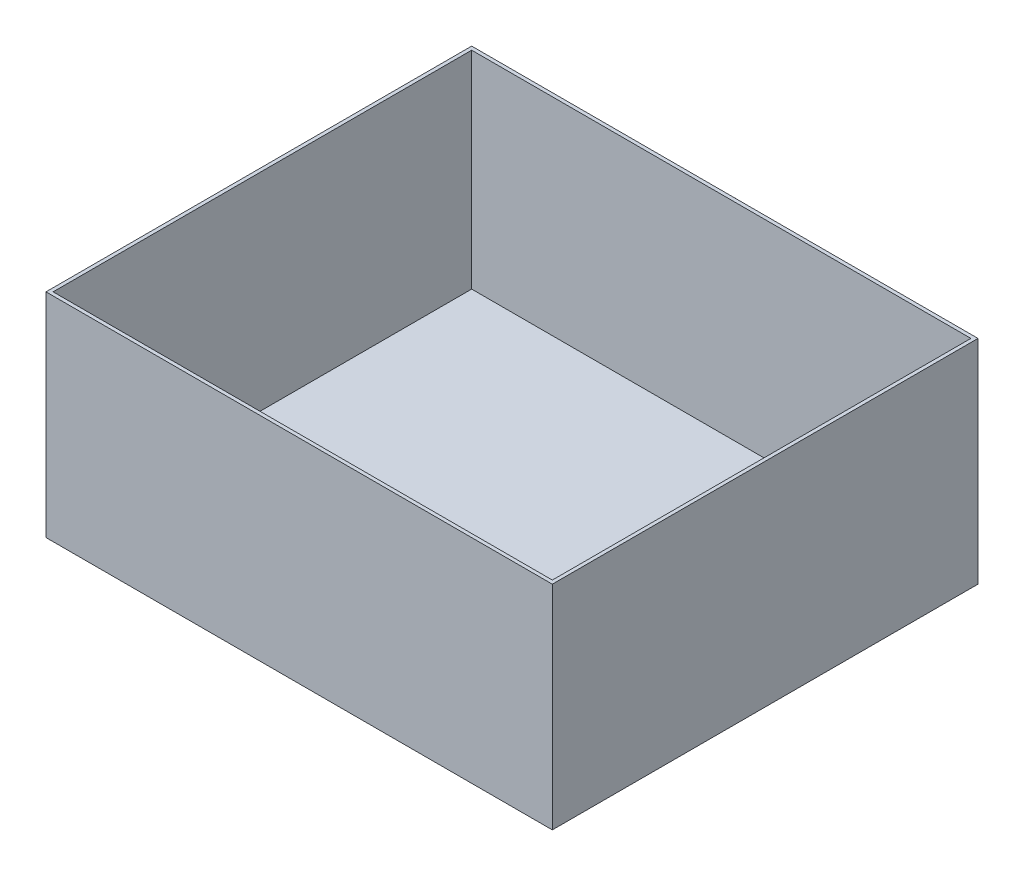
ISO-10303-21;
HEADER;
FILE_DESCRIPTION(('STEP AP214'),'2;1');
FILE_NAME('part.step','',(''),(''),'','','');
FILE_SCHEMA(('AUTOMOTIVE_DESIGN { 1 0 10303 214 1 1 1 1 }'));
ENDSEC;
DATA;
#1=APPLICATION_CONTEXT('core data for automotive mechanical design processes');
#2=APPLICATION_PROTOCOL_DEFINITION('international standard','automotive_design',2000,#1);
#3=PRODUCT_CONTEXT('',#1,'mechanical');
#4=PRODUCT('Part','Part','',(#3));
#5=PRODUCT_RELATED_PRODUCT_CATEGORY('part','',(#4));
#6=PRODUCT_DEFINITION_FORMATION('','',#4);
#7=PRODUCT_DEFINITION_CONTEXT('part definition',#1,'design');
#8=PRODUCT_DEFINITION('design','',#6,#7);
#9=PRODUCT_DEFINITION_SHAPE('','',#8);
#10=(LENGTH_UNIT() NAMED_UNIT(*) SI_UNIT(.MILLI.,.METRE.));
#11=(NAMED_UNIT(*) PLANE_ANGLE_UNIT() SI_UNIT($,.RADIAN.));
#12=(NAMED_UNIT(*) SI_UNIT($,.STERADIAN.) SOLID_ANGLE_UNIT());
#13=UNCERTAINTY_MEASURE_WITH_UNIT(LENGTH_MEASURE(1.E-05),#10,'distance_accuracy_value','');
#14=(GEOMETRIC_REPRESENTATION_CONTEXT(3) GLOBAL_UNCERTAINTY_ASSIGNED_CONTEXT((#13)) GLOBAL_UNIT_ASSIGNED_CONTEXT((#10,
#11,#12)) REPRESENTATION_CONTEXT('',''));
#15=CARTESIAN_POINT('',(0.,0.,0.));
#16=DIRECTION('',(0.,0.,1.));
#17=DIRECTION('',(1.,0.,0.));
#18=AXIS2_PLACEMENT_3D('',#15,#16,#17);
#19=CARTESIAN_POINT('',(0.,90.,0.));
#20=DIRECTION('',(1.,0.,0.));
#21=DIRECTION('',(0.,0.,-1.));
#22=AXIS2_PLACEMENT_3D('',#19,#20,#21);
#23=PLANE('',#22);
#24=DIRECTION('',(0.,0.,1.));
#25=VECTOR('',#24,1.);
#26=CARTESIAN_POINT('',(0.,0.,0.));
#27=LINE('',#26,#25);
#28=CARTESIAN_POINT('',(0.,0.,-180.));
#29=VERTEX_POINT('',#28);
#30=CARTESIAN_POINT('',(0.,0.,0.));
#31=VERTEX_POINT('',#30);
#32=EDGE_CURVE('E140',#29,#31,#27,.T.);
#33=ORIENTED_EDGE('',*,*,#32,.T.);
#34=DIRECTION('',(0.,-1.,0.));
#35=VECTOR('',#34,1.);
#36=CARTESIAN_POINT('',(0.,90.,0.));
#37=LINE('',#36,#35);
#38=CARTESIAN_POINT('',(0.,90.,0.));
#39=VERTEX_POINT('',#38);
#40=EDGE_CURVE('E11',#39,#31,#37,.T.);
#41=ORIENTED_EDGE('',*,*,#40,.F.);
#42=DIRECTION('',(0.,0.,1.));
#43=VECTOR('',#42,1.);
#44=CARTESIAN_POINT('',(0.,90.,0.));
#45=LINE('',#44,#43);
#46=CARTESIAN_POINT('',(0.,90.,-180.));
#47=VERTEX_POINT('',#46);
#48=EDGE_CURVE('E144',#47,#39,#45,.T.);
#49=ORIENTED_EDGE('',*,*,#48,.F.);
#50=DIRECTION('',(0.,-1.,0.));
#51=VECTOR('',#50,1.);
#52=CARTESIAN_POINT('',(0.,90.,-180.));
#53=LINE('',#52,#51);
#54=EDGE_CURVE('E150',#47,#29,#53,.T.);
#55=ORIENTED_EDGE('',*,*,#54,.T.);
#56=EDGE_LOOP('',(#33,#41,#49,#55));
#57=FACE_BOUND('',#56,.T.);
#58=ADVANCED_FACE('F32',(#57),#23,.F.);
#59=CARTESIAN_POINT('',(0.,90.,0.));
#60=DIRECTION('',(0.,0.,-1.));
#61=DIRECTION('',(-1.,0.,0.));
#62=AXIS2_PLACEMENT_3D('',#59,#60,#61);
#63=PLANE('',#62);
#64=DIRECTION('',(1.,0.,0.));
#65=VECTOR('',#64,1.);
#66=CARTESIAN_POINT('',(0.,0.,0.));
#67=LINE('',#66,#65);
#68=CARTESIAN_POINT('',(214.105532568095,0.,0.));
#69=VERTEX_POINT('',#68);
#70=EDGE_CURVE('E153',#31,#69,#67,.T.);
#71=ORIENTED_EDGE('',*,*,#70,.T.);
#72=DIRECTION('',(0.,-1.,0.));
#73=VECTOR('',#72,1.);
#74=CARTESIAN_POINT('',(214.105532568095,90.,0.));
#75=LINE('',#74,#73);
#76=CARTESIAN_POINT('',(214.105532568095,90.,0.));
#77=VERTEX_POINT('',#76);
#78=EDGE_CURVE('E39',#77,#69,#75,.T.);
#79=ORIENTED_EDGE('',*,*,#78,.F.);
#80=DIRECTION('',(1.,0.,0.));
#81=VECTOR('',#80,1.);
#82=CARTESIAN_POINT('',(0.,90.,0.));
#83=LINE('',#82,#81);
#84=EDGE_CURVE('E83',#39,#77,#83,.T.);
#85=ORIENTED_EDGE('',*,*,#84,.F.);
#86=ORIENTED_EDGE('',*,*,#40,.T.);
#87=EDGE_LOOP('',(#71,#79,#85,#86));
#88=FACE_BOUND('',#87,.T.);
#89=ADVANCED_FACE('F182',(#88),#63,.F.);
#90=CARTESIAN_POINT('',(214.105532568095,90.,0.));
#91=DIRECTION('',(-1.,0.,0.));
#92=DIRECTION('',(0.,0.,1.));
#93=AXIS2_PLACEMENT_3D('',#90,#91,#92);
#94=PLANE('',#93);
#95=DIRECTION('',(0.,0.,-1.));
#96=VECTOR('',#95,1.);
#97=CARTESIAN_POINT('',(214.105532568095,0.,0.));
#98=LINE('',#97,#96);
#99=CARTESIAN_POINT('',(214.105532568095,0.,-180.));
#100=VERTEX_POINT('',#99);
#101=EDGE_CURVE('E155',#69,#100,#98,.T.);
#102=ORIENTED_EDGE('',*,*,#101,.T.);
#103=DIRECTION('',(0.,-1.,0.));
#104=VECTOR('',#103,1.);
#105=CARTESIAN_POINT('',(214.105532568095,90.,-180.));
#106=LINE('',#105,#104);
#107=CARTESIAN_POINT('',(214.105532568095,90.,-180.));
#108=VERTEX_POINT('',#107);
#109=EDGE_CURVE('E159',#108,#100,#106,.T.);
#110=ORIENTED_EDGE('',*,*,#109,.F.);
#111=DIRECTION('',(0.,0.,-1.));
#112=VECTOR('',#111,1.);
#113=CARTESIAN_POINT('',(214.105532568095,90.,0.));
#114=LINE('',#113,#112);
#115=EDGE_CURVE('E147',#77,#108,#114,.T.);
#116=ORIENTED_EDGE('',*,*,#115,.F.);
#117=ORIENTED_EDGE('',*,*,#78,.T.);
#118=EDGE_LOOP('',(#102,#110,#116,#117));
#119=FACE_BOUND('',#118,.T.);
#120=ADVANCED_FACE('F164',(#119),#94,.F.);
#121=CARTESIAN_POINT('',(0.,90.,-180.));
#122=DIRECTION('',(0.,0.,1.));
#123=DIRECTION('',(1.,0.,0.));
#124=AXIS2_PLACEMENT_3D('',#121,#122,#123);
#125=PLANE('',#124);
#126=DIRECTION('',(-1.,0.,0.));
#127=VECTOR('',#126,1.);
#128=CARTESIAN_POINT('',(0.,0.,-180.));
#129=LINE('',#128,#127);
#130=EDGE_CURVE('E76',#100,#29,#129,.T.);
#131=ORIENTED_EDGE('',*,*,#130,.T.);
#132=ORIENTED_EDGE('',*,*,#54,.F.);
#133=DIRECTION('',(-1.,0.,0.));
#134=VECTOR('',#133,1.);
#135=CARTESIAN_POINT('',(0.,90.,-180.));
#136=LINE('',#135,#134);
#137=EDGE_CURVE('E55',#108,#47,#136,.T.);
#138=ORIENTED_EDGE('',*,*,#137,.F.);
#139=ORIENTED_EDGE('',*,*,#109,.T.);
#140=EDGE_LOOP('',(#131,#132,#138,#139));
#141=FACE_BOUND('',#140,.T.);
#142=ADVANCED_FACE('F172',(#141),#125,.F.);
#143=CARTESIAN_POINT('',(0.,90.,0.));
#144=DIRECTION('',(0.,-1.,0.));
#145=DIRECTION('',(0.,0.,-1.));
#146=AXIS2_PLACEMENT_3D('',#143,#144,#145);
#147=PLANE('',#146);
#148=DIRECTION('',(1.,0.,0.));
#149=VECTOR('',#148,1.);
#150=CARTESIAN_POINT('',(1.49999999999791,90.,-1.49999999999997));
#151=LINE('',#150,#149);
#152=CARTESIAN_POINT('',(1.49999999999791,90.,-1.49999999999997));
#153=VERTEX_POINT('',#152);
#154=CARTESIAN_POINT('',(212.605532568097,90.,-1.49999999999997));
#155=VERTEX_POINT('',#154);
#156=EDGE_CURVE('E134',#153,#155,#151,.T.);
#157=ORIENTED_EDGE('',*,*,#156,.F.);
#158=DIRECTION('',(0.,0.,1.));
#159=VECTOR('',#158,1.);
#160=CARTESIAN_POINT('',(1.49999999999787,90.,-178.5));
#161=LINE('',#160,#159);
#162=CARTESIAN_POINT('',(1.49999999999787,90.,-178.5));
#163=VERTEX_POINT('',#162);
#164=EDGE_CURVE('E46',#163,#153,#161,.T.);
#165=ORIENTED_EDGE('',*,*,#164,.F.);
#166=DIRECTION('',(-1.,0.,0.));
#167=VECTOR('',#166,1.);
#168=CARTESIAN_POINT('',(1.49999999999787,90.,-178.5));
#169=LINE('',#168,#167);
#170=CARTESIAN_POINT('',(212.605532568097,90.,-178.5));
#171=VERTEX_POINT('',#170);
#172=EDGE_CURVE('E125',#171,#163,#169,.T.);
#173=ORIENTED_EDGE('',*,*,#172,.F.);
#174=DIRECTION('',(0.,0.,-1.));
#175=VECTOR('',#174,1.);
#176=CARTESIAN_POINT('',(212.605532568097,90.,-178.5));
#177=LINE('',#176,#175);
#178=EDGE_CURVE('E128',#155,#171,#177,.T.);
#179=ORIENTED_EDGE('',*,*,#178,.F.);
#180=EDGE_LOOP('',(#157,#165,#173,#179));
#181=FACE_BOUND('',#180,.T.);
#182=ORIENTED_EDGE('',*,*,#48,.T.);
#183=ORIENTED_EDGE('',*,*,#84,.T.);
#184=ORIENTED_EDGE('',*,*,#115,.T.);
#185=ORIENTED_EDGE('',*,*,#137,.T.);
#186=EDGE_LOOP('',(#182,#183,#184,#185));
#187=FACE_BOUND('',#186,.T.);
#188=ADVANCED_FACE('F174',(#181,#187),#147,.F.);
#189=CARTESIAN_POINT('',(0.,0.,0.));
#190=DIRECTION('',(0.,-1.,0.));
#191=DIRECTION('',(0.,0.,-1.));
#192=AXIS2_PLACEMENT_3D('',#189,#190,#191);
#193=PLANE('',#192);
#194=ORIENTED_EDGE('',*,*,#32,.F.);
#195=ORIENTED_EDGE('',*,*,#130,.F.);
#196=ORIENTED_EDGE('',*,*,#101,.F.);
#197=ORIENTED_EDGE('',*,*,#70,.F.);
#198=EDGE_LOOP('',(#194,#195,#196,#197));
#199=FACE_BOUND('',#198,.T.);
#200=ADVANCED_FACE('F168',(#199),#193,.T.);
#201=CARTESIAN_POINT('',(1.49999999999787,2.5,-178.5));
#202=DIRECTION('',(-1.,0.,0.));
#203=DIRECTION('',(0.,0.,1.));
#204=AXIS2_PLACEMENT_3D('',#201,#202,#203);
#205=PLANE('',#204);
#206=ORIENTED_EDGE('',*,*,#164,.T.);
#207=DIRECTION('',(0.,1.,0.));
#208=VECTOR('',#207,1.);
#209=CARTESIAN_POINT('',(1.49999999999791,2.5,-1.49999999999997));
#210=LINE('',#209,#208);
#211=CARTESIAN_POINT('',(1.49999999999791,2.5,-1.49999999999997));
#212=VERTEX_POINT('',#211);
#213=EDGE_CURVE('E103',#212,#153,#210,.T.);
#214=ORIENTED_EDGE('',*,*,#213,.F.);
#215=DIRECTION('',(0.,0.,1.));
#216=VECTOR('',#215,1.);
#217=CARTESIAN_POINT('',(1.49999999999787,2.5,-178.5));
#218=LINE('',#217,#216);
#219=CARTESIAN_POINT('',(1.49999999999787,2.5,-178.5));
#220=VERTEX_POINT('',#219);
#221=EDGE_CURVE('E107',#220,#212,#218,.T.);
#222=ORIENTED_EDGE('',*,*,#221,.F.);
#223=DIRECTION('',(0.,1.,0.));
#224=VECTOR('',#223,1.);
#225=CARTESIAN_POINT('',(1.49999999999787,2.5,-178.5));
#226=LINE('',#225,#224);
#227=EDGE_CURVE('E138',#220,#163,#226,.T.);
#228=ORIENTED_EDGE('',*,*,#227,.T.);
#229=EDGE_LOOP('',(#206,#214,#222,#228));
#230=FACE_BOUND('',#229,.T.);
#231=ADVANCED_FACE('F105',(#230),#205,.F.);
#232=CARTESIAN_POINT('',(1.49999999999787,2.5,-178.5));
#233=DIRECTION('',(0.,0.,-1.));
#234=DIRECTION('',(-1.,0.,0.));
#235=AXIS2_PLACEMENT_3D('',#232,#233,#234);
#236=PLANE('',#235);
#237=ORIENTED_EDGE('',*,*,#172,.T.);
#238=ORIENTED_EDGE('',*,*,#227,.F.);
#239=DIRECTION('',(-1.,0.,0.));
#240=VECTOR('',#239,1.);
#241=CARTESIAN_POINT('',(1.49999999999787,2.5,-178.5));
#242=LINE('',#241,#240);
#243=CARTESIAN_POINT('',(212.605532568097,2.5,-178.5));
#244=VERTEX_POINT('',#243);
#245=EDGE_CURVE('E113',#244,#220,#242,.T.);
#246=ORIENTED_EDGE('',*,*,#245,.F.);
#247=DIRECTION('',(0.,1.,0.));
#248=VECTOR('',#247,1.);
#249=CARTESIAN_POINT('',(212.605532568097,2.5,-178.5));
#250=LINE('',#249,#248);
#251=EDGE_CURVE('E141',#244,#171,#250,.T.);
#252=ORIENTED_EDGE('',*,*,#251,.T.);
#253=EDGE_LOOP('',(#237,#238,#246,#252));
#254=FACE_BOUND('',#253,.T.);
#255=ADVANCED_FACE('F221',(#254),#236,.F.);
#256=CARTESIAN_POINT('',(212.605532568097,2.5,-178.5));
#257=DIRECTION('',(1.,0.,0.));
#258=DIRECTION('',(0.,0.,-1.));
#259=AXIS2_PLACEMENT_3D('',#256,#257,#258);
#260=PLANE('',#259);
#261=ORIENTED_EDGE('',*,*,#178,.T.);
#262=ORIENTED_EDGE('',*,*,#251,.F.);
#263=DIRECTION('',(0.,0.,-1.));
#264=VECTOR('',#263,1.);
#265=CARTESIAN_POINT('',(212.605532568097,2.5,-178.5));
#266=LINE('',#265,#264);
#267=CARTESIAN_POINT('',(212.605532568097,2.5,-1.49999999999997));
#268=VERTEX_POINT('',#267);
#269=EDGE_CURVE('E121',#268,#244,#266,.T.);
#270=ORIENTED_EDGE('',*,*,#269,.F.);
#271=DIRECTION('',(0.,1.,0.));
#272=VECTOR('',#271,1.);
#273=CARTESIAN_POINT('',(212.605532568097,2.5,-1.49999999999997));
#274=LINE('',#273,#272);
#275=EDGE_CURVE('E112',#268,#155,#274,.T.);
#276=ORIENTED_EDGE('',*,*,#275,.T.);
#277=EDGE_LOOP('',(#261,#262,#270,#276));
#278=FACE_BOUND('',#277,.T.);
#279=ADVANCED_FACE('F230',(#278),#260,.F.);
#280=CARTESIAN_POINT('',(1.49999999999791,2.5,-1.49999999999997));
#281=DIRECTION('',(0.,0.,1.));
#282=DIRECTION('',(1.,0.,0.));
#283=AXIS2_PLACEMENT_3D('',#280,#281,#282);
#284=PLANE('',#283);
#285=ORIENTED_EDGE('',*,*,#156,.T.);
#286=ORIENTED_EDGE('',*,*,#275,.F.);
#287=DIRECTION('',(1.,0.,0.));
#288=VECTOR('',#287,1.);
#289=CARTESIAN_POINT('',(1.49999999999791,2.5,-1.49999999999997));
#290=LINE('',#289,#288);
#291=EDGE_CURVE('E116',#212,#268,#290,.T.);
#292=ORIENTED_EDGE('',*,*,#291,.F.);
#293=ORIENTED_EDGE('',*,*,#213,.T.);
#294=EDGE_LOOP('',(#285,#286,#292,#293));
#295=FACE_BOUND('',#294,.T.);
#296=ADVANCED_FACE('F117',(#295),#284,.F.);
#297=CARTESIAN_POINT('',(0.,2.5,0.));
#298=DIRECTION('',(0.,1.,0.));
#299=DIRECTION('',(0.,0.,1.));
#300=AXIS2_PLACEMENT_3D('',#297,#298,#299);
#301=PLANE('',#300);
#302=ORIENTED_EDGE('',*,*,#221,.T.);
#303=ORIENTED_EDGE('',*,*,#291,.T.);
#304=ORIENTED_EDGE('',*,*,#269,.T.);
#305=ORIENTED_EDGE('',*,*,#245,.T.);
#306=EDGE_LOOP('',(#302,#303,#304,#305));
#307=FACE_BOUND('',#306,.T.);
#308=ADVANCED_FACE('F123',(#307),#301,.T.);
#309=CLOSED_SHELL('',(#58,#89,#120,#142,#188,#200,#231,#255,#279,#296,#308));
#310=MANIFOLD_SOLID_BREP('B2',#309);
#311=ADVANCED_BREP_SHAPE_REPRESENTATION('',(#18,#310),#14);
#312=SHAPE_DEFINITION_REPRESENTATION(#9,#311);
ENDSEC;
END-ISO-10303-21;
